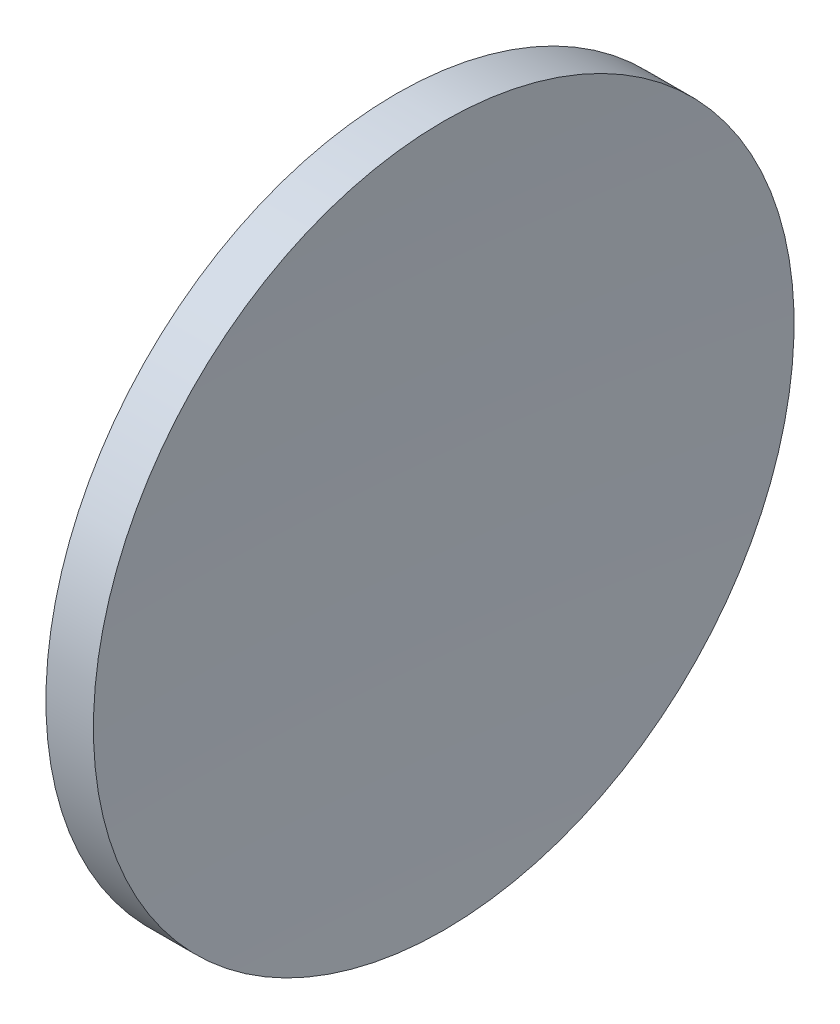
ISO-10303-21;
HEADER;
FILE_DESCRIPTION(('STEP AP214'),'2;1');
FILE_NAME('part.step','',(''),(''),'','','');
FILE_SCHEMA(('AUTOMOTIVE_DESIGN { 1 0 10303 214 1 1 1 1 }'));
ENDSEC;
DATA;
#1=APPLICATION_CONTEXT('core data for automotive mechanical design processes');
#2=APPLICATION_PROTOCOL_DEFINITION('international standard','automotive_design',2000,#1);
#3=PRODUCT_CONTEXT('',#1,'mechanical');
#4=PRODUCT('Part','Part','',(#3));
#5=PRODUCT_RELATED_PRODUCT_CATEGORY('part','',(#4));
#6=PRODUCT_DEFINITION_FORMATION('','',#4);
#7=PRODUCT_DEFINITION_CONTEXT('part definition',#1,'design');
#8=PRODUCT_DEFINITION('design','',#6,#7);
#9=PRODUCT_DEFINITION_SHAPE('','',#8);
#10=(LENGTH_UNIT() NAMED_UNIT(*) SI_UNIT(.MILLI.,.METRE.));
#11=(NAMED_UNIT(*) PLANE_ANGLE_UNIT() SI_UNIT($,.RADIAN.));
#12=(NAMED_UNIT(*) SI_UNIT($,.STERADIAN.) SOLID_ANGLE_UNIT());
#13=UNCERTAINTY_MEASURE_WITH_UNIT(LENGTH_MEASURE(1.E-05),#10,'distance_accuracy_value','');
#14=(GEOMETRIC_REPRESENTATION_CONTEXT(3) GLOBAL_UNCERTAINTY_ASSIGNED_CONTEXT((#13)) GLOBAL_UNIT_ASSIGNED_CONTEXT((#10,
#11,#12)) REPRESENTATION_CONTEXT('',''));
#15=CARTESIAN_POINT('',(0.,0.,0.));
#16=DIRECTION('',(0.,0.,1.));
#17=DIRECTION('',(1.,0.,0.));
#18=AXIS2_PLACEMENT_3D('',#15,#16,#17);
#19=CARTESIAN_POINT('',(727.78213112149,130.43368094188,0.));
#20=DIRECTION('',(-1.,0.,0.));
#21=DIRECTION('',(0.,1.,0.));
#22=AXIS2_PLACEMENT_3D('',#19,#20,#21);
#23=SPHERICAL_SURFACE('',#22,478.);
#24=CARTESIAN_POINT('',(250.43634450554,130.433680941881,0.));
#25=DIRECTION('',(-1.,0.,0.));
#26=DIRECTION('',(0.,-1.,0.));
#27=AXIS2_PLACEMENT_3D('',#24,#25,#26);
#28=CIRCLE('',#27,25.0000000000001);
#29=CARTESIAN_POINT('',(250.43634450554,105.433680941881,0.));
#30=VERTEX_POINT('',#29);
#31=EDGE_CURVE('E10',#30,#30,#28,.T.);
#32=ORIENTED_EDGE('',*,*,#31,.F.);
#33=EDGE_LOOP('',(#32));
#34=FACE_BOUND('',#33,.T.);
#35=ADVANCED_FACE('F35',(#34),#23,.F.);
#36=CARTESIAN_POINT('',(231.888982595926,130.433680941881,0.));
#37=DIRECTION('',(-1.,0.,0.));
#38=DIRECTION('',(0.,-1.,0.));
#39=AXIS2_PLACEMENT_3D('',#36,#37,#38);
#40=CYLINDRICAL_SURFACE('',#39,25.);
#41=CARTESIAN_POINT('',(247.046493408796,130.433680941881,0.));
#42=DIRECTION('',(-1.,0.,0.));
#43=DIRECTION('',(0.,-1.,0.));
#44=AXIS2_PLACEMENT_3D('',#41,#42,#43);
#45=CIRCLE('',#44,25.);
#46=CARTESIAN_POINT('',(247.046493408796,105.433680941881,0.));
#47=VERTEX_POINT('',#46);
#48=EDGE_CURVE('E41',#47,#47,#45,.T.);
#49=ORIENTED_EDGE('',*,*,#48,.F.);
#50=EDGE_LOOP('',(#49));
#51=FACE_BOUND('',#50,.T.);
#52=ORIENTED_EDGE('',*,*,#31,.T.);
#53=EDGE_LOOP('',(#52));
#54=FACE_BOUND('',#53,.T.);
#55=ADVANCED_FACE('F49',(#51,#54),#40,.T.);
#56=CARTESIAN_POINT('',(423.28213112149,130.433680941881,0.));
#57=DIRECTION('',(-1.,0.,0.));
#58=DIRECTION('',(0.,1.,0.));
#59=AXIS2_PLACEMENT_3D('',#56,#57,#58);
#60=SPHERICAL_SURFACE('',#59,178.);
#61=ORIENTED_EDGE('',*,*,#48,.T.);
#62=EDGE_LOOP('',(#61));
#63=FACE_BOUND('',#62,.T.);
#64=ADVANCED_FACE('F47',(#63),#60,.T.);
#65=CLOSED_SHELL('',(#35,#55,#64));
#66=MANIFOLD_SOLID_BREP('B2',#65);
#67=ADVANCED_BREP_SHAPE_REPRESENTATION('',(#18,#66),#14);
#68=SHAPE_DEFINITION_REPRESENTATION(#9,#67);
ENDSEC;
END-ISO-10303-21;
